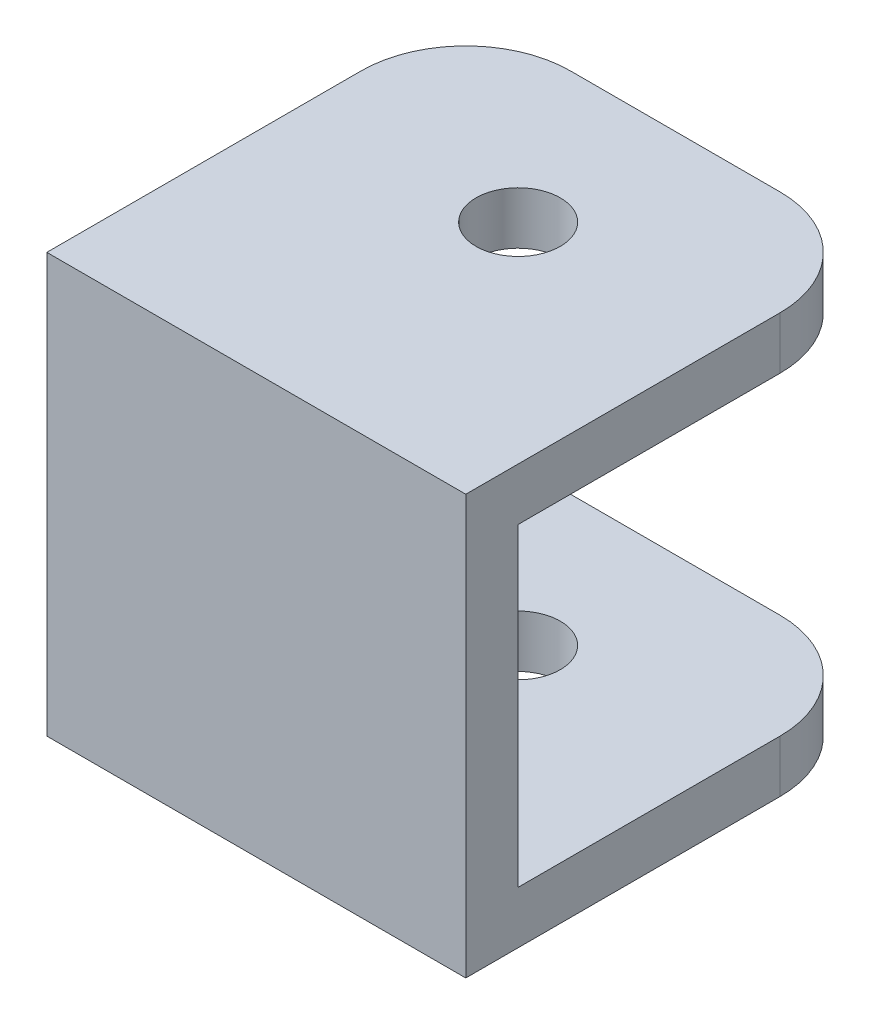
ISO-10303-21;
HEADER;
FILE_DESCRIPTION(('STEP AP214'),'2;1');
FILE_NAME('part.step','',(''),(''),'','','');
FILE_SCHEMA(('AUTOMOTIVE_DESIGN { 1 0 10303 214 1 1 1 1 }'));
ENDSEC;
DATA;
#1=APPLICATION_CONTEXT('core data for automotive mechanical design processes');
#2=APPLICATION_PROTOCOL_DEFINITION('international standard','automotive_design',2000,#1);
#3=PRODUCT_CONTEXT('',#1,'mechanical');
#4=PRODUCT('Part','Part','',(#3));
#5=PRODUCT_RELATED_PRODUCT_CATEGORY('part','',(#4));
#6=PRODUCT_DEFINITION_FORMATION('','',#4);
#7=PRODUCT_DEFINITION_CONTEXT('part definition',#1,'design');
#8=PRODUCT_DEFINITION('design','',#6,#7);
#9=PRODUCT_DEFINITION_SHAPE('','',#8);
#10=(LENGTH_UNIT() NAMED_UNIT(*) SI_UNIT(.MILLI.,.METRE.));
#11=(NAMED_UNIT(*) PLANE_ANGLE_UNIT() SI_UNIT($,.RADIAN.));
#12=(NAMED_UNIT(*) SI_UNIT($,.STERADIAN.) SOLID_ANGLE_UNIT());
#13=UNCERTAINTY_MEASURE_WITH_UNIT(LENGTH_MEASURE(1.E-05),#10,'distance_accuracy_value','');
#14=(GEOMETRIC_REPRESENTATION_CONTEXT(3) GLOBAL_UNCERTAINTY_ASSIGNED_CONTEXT((#13)) GLOBAL_UNIT_ASSIGNED_CONTEXT((#10,
#11,#12)) REPRESENTATION_CONTEXT('',''));
#15=CARTESIAN_POINT('',(0.,0.,0.));
#16=DIRECTION('',(0.,0.,1.));
#17=DIRECTION('',(1.,0.,0.));
#18=AXIS2_PLACEMENT_3D('',#15,#16,#17);
#19=CARTESIAN_POINT('',(-12.7,-12.7,-25.4));
#20=DIRECTION('',(0.,0.,-1.));
#21=DIRECTION('',(-1.,0.,0.));
#22=AXIS2_PLACEMENT_3D('',#19,#20,#21);
#23=PLANE('',#22);
#24=DIRECTION('',(1.,0.,0.));
#25=VECTOR('',#24,1.);
#26=CARTESIAN_POINT('',(-12.7,-12.7,-25.4));
#27=LINE('',#26,#25);
#28=CARTESIAN_POINT('',(-6.35,-12.7,-25.4));
#29=VERTEX_POINT('',#28);
#30=CARTESIAN_POINT('',(6.35,-12.7,-25.4));
#31=VERTEX_POINT('',#30);
#32=EDGE_CURVE('E173',#29,#31,#27,.T.);
#33=ORIENTED_EDGE('',*,*,#32,.F.);
#34=DIRECTION('',(0.,-1.,0.));
#35=VECTOR('',#34,1.);
#36=CARTESIAN_POINT('',(-6.35,45.81144,-25.4));
#37=LINE('',#36,#35);
#38=CARTESIAN_POINT('',(-6.35,-9.525,-25.4));
#39=VERTEX_POINT('',#38);
#40=EDGE_CURVE('E115',#39,#29,#37,.T.);
#41=ORIENTED_EDGE('',*,*,#40,.F.);
#42=DIRECTION('',(1.,0.,0.));
#43=VECTOR('',#42,1.);
#44=CARTESIAN_POINT('',(-12.7,-9.525,-25.4));
#45=LINE('',#44,#43);
#46=CARTESIAN_POINT('',(6.35,-9.525,-25.4));
#47=VERTEX_POINT('',#46);
#48=EDGE_CURVE('E114',#47,#39,#45,.F.);
#49=ORIENTED_EDGE('',*,*,#48,.F.);
#50=DIRECTION('',(0.,1.,0.));
#51=VECTOR('',#50,1.);
#52=CARTESIAN_POINT('',(6.35,-45.81144,-25.4));
#53=LINE('',#52,#51);
#54=EDGE_CURVE('E110',#31,#47,#53,.T.);
#55=ORIENTED_EDGE('',*,*,#54,.F.);
#56=EDGE_LOOP('',(#33,#41,#49,#55));
#57=FACE_BOUND('',#56,.T.);
#58=ADVANCED_FACE('F17',(#57),#23,.T.);
#59=CARTESIAN_POINT('',(0.,-12.7,-15.875));
#60=DIRECTION('',(0.,1.,0.));
#61=DIRECTION('',(0.,0.,1.));
#62=AXIS2_PLACEMENT_3D('',#59,#60,#61);
#63=CYLINDRICAL_SURFACE('',#62,2.5527);
#64=CARTESIAN_POINT('',(0.,-9.525,-15.875));
#65=DIRECTION('',(0.,1.,0.));
#66=DIRECTION('',(0.,0.,1.));
#67=AXIS2_PLACEMENT_3D('',#64,#65,#66);
#68=CIRCLE('',#67,2.5527);
#69=CARTESIAN_POINT('',(0.,-9.525,-13.3223));
#70=VERTEX_POINT('',#69);
#71=EDGE_CURVE('E183',#70,#70,#68,.F.);
#72=ORIENTED_EDGE('',*,*,#71,.F.);
#73=EDGE_LOOP('',(#72));
#74=FACE_BOUND('',#73,.T.);
#75=CARTESIAN_POINT('',(0.,-12.7,-15.875));
#76=DIRECTION('',(0.,1.,0.));
#77=DIRECTION('',(0.,0.,1.));
#78=AXIS2_PLACEMENT_3D('',#75,#76,#77);
#79=CIRCLE('',#78,2.5527);
#80=CARTESIAN_POINT('',(0.,-12.7,-13.3223));
#81=VERTEX_POINT('',#80);
#82=EDGE_CURVE('E125',#81,#81,#79,.T.);
#83=ORIENTED_EDGE('',*,*,#82,.F.);
#84=EDGE_LOOP('',(#83));
#85=FACE_BOUND('',#84,.T.);
#86=ADVANCED_FACE('F313',(#74,#85),#63,.F.);
#87=CARTESIAN_POINT('',(6.35,-45.81144,-19.05));
#88=DIRECTION('',(0.,1.,0.));
#89=DIRECTION('',(0.,0.,1.));
#90=AXIS2_PLACEMENT_3D('',#87,#88,#89);
#91=CYLINDRICAL_SURFACE('',#90,6.35);
#92=ORIENTED_EDGE('',*,*,#54,.T.);
#93=CARTESIAN_POINT('',(6.35,-9.525,-19.05));
#94=DIRECTION('',(0.,1.,0.));
#95=DIRECTION('',(0.,0.,1.));
#96=AXIS2_PLACEMENT_3D('',#93,#94,#95);
#97=CIRCLE('',#96,6.35);
#98=CARTESIAN_POINT('',(12.7,-9.525,-19.05));
#99=VERTEX_POINT('',#98);
#100=EDGE_CURVE('E20',#99,#47,#97,.T.);
#101=ORIENTED_EDGE('',*,*,#100,.F.);
#102=DIRECTION('',(0.,1.,0.));
#103=VECTOR('',#102,1.);
#104=CARTESIAN_POINT('',(12.7,0.,-19.05));
#105=LINE('',#104,#103);
#106=CARTESIAN_POINT('',(12.7,-12.7,-19.05));
#107=VERTEX_POINT('',#106);
#108=EDGE_CURVE('E108',#107,#99,#105,.T.);
#109=ORIENTED_EDGE('',*,*,#108,.F.);
#110=CARTESIAN_POINT('',(6.35,-12.7,-19.05));
#111=DIRECTION('',(0.,1.,0.));
#112=DIRECTION('',(0.,0.,1.));
#113=AXIS2_PLACEMENT_3D('',#110,#111,#112);
#114=CIRCLE('',#113,6.35);
#115=EDGE_CURVE('E171',#31,#107,#114,.F.);
#116=ORIENTED_EDGE('',*,*,#115,.F.);
#117=EDGE_LOOP('',(#92,#101,#109,#116));
#118=FACE_BOUND('',#117,.T.);
#119=ADVANCED_FACE('F105',(#118),#91,.T.);
#120=CARTESIAN_POINT('',(-12.7,9.525,-25.4));
#121=DIRECTION('',(0.,0.,-1.));
#122=DIRECTION('',(-1.,0.,0.));
#123=AXIS2_PLACEMENT_3D('',#120,#121,#122);
#124=PLANE('',#123);
#125=DIRECTION('',(1.,0.,0.));
#126=VECTOR('',#125,1.);
#127=CARTESIAN_POINT('',(-12.7,12.7,-25.4));
#128=LINE('',#127,#126);
#129=CARTESIAN_POINT('',(6.35,12.7,-25.4));
#130=VERTEX_POINT('',#129);
#131=CARTESIAN_POINT('',(-6.35,12.7,-25.4));
#132=VERTEX_POINT('',#131);
#133=EDGE_CURVE('E130',#130,#132,#128,.F.);
#134=ORIENTED_EDGE('',*,*,#133,.F.);
#135=DIRECTION('',(0.,1.,0.));
#136=VECTOR('',#135,1.);
#137=CARTESIAN_POINT('',(6.35,-45.81144,-25.4));
#138=LINE('',#137,#136);
#139=CARTESIAN_POINT('',(6.35,9.525,-25.4));
#140=VERTEX_POINT('',#139);
#141=EDGE_CURVE('E155',#140,#130,#138,.T.);
#142=ORIENTED_EDGE('',*,*,#141,.F.);
#143=DIRECTION('',(1.,0.,0.));
#144=VECTOR('',#143,1.);
#145=CARTESIAN_POINT('',(-12.7,9.525,-25.4));
#146=LINE('',#145,#144);
#147=CARTESIAN_POINT('',(-6.35,9.525,-25.4));
#148=VERTEX_POINT('',#147);
#149=EDGE_CURVE('E182',#148,#140,#146,.T.);
#150=ORIENTED_EDGE('',*,*,#149,.F.);
#151=DIRECTION('',(0.,-1.,0.));
#152=VECTOR('',#151,1.);
#153=CARTESIAN_POINT('',(-6.35,45.81144,-25.4));
#154=LINE('',#153,#152);
#155=EDGE_CURVE('E138',#132,#148,#154,.T.);
#156=ORIENTED_EDGE('',*,*,#155,.F.);
#157=EDGE_LOOP('',(#134,#142,#150,#156));
#158=FACE_BOUND('',#157,.T.);
#159=ADVANCED_FACE('F259',(#158),#124,.T.);
#160=CARTESIAN_POINT('',(6.35,-45.81144,-19.05));
#161=DIRECTION('',(0.,1.,0.));
#162=DIRECTION('',(0.,0.,1.));
#163=AXIS2_PLACEMENT_3D('',#160,#161,#162);
#164=CYLINDRICAL_SURFACE('',#163,6.35);
#165=ORIENTED_EDGE('',*,*,#141,.T.);
#166=CARTESIAN_POINT('',(6.35,12.7,-19.05));
#167=DIRECTION('',(0.,1.,0.));
#168=DIRECTION('',(0.,0.,1.));
#169=AXIS2_PLACEMENT_3D('',#166,#167,#168);
#170=CIRCLE('',#169,6.35);
#171=CARTESIAN_POINT('',(12.7,12.7,-19.05));
#172=VERTEX_POINT('',#171);
#173=EDGE_CURVE('E161',#172,#130,#170,.T.);
#174=ORIENTED_EDGE('',*,*,#173,.F.);
#175=DIRECTION('',(0.,1.,0.));
#176=VECTOR('',#175,1.);
#177=CARTESIAN_POINT('',(12.7,0.,-19.05));
#178=LINE('',#177,#176);
#179=CARTESIAN_POINT('',(12.7,9.525,-19.05));
#180=VERTEX_POINT('',#179);
#181=EDGE_CURVE('E135',#180,#172,#178,.T.);
#182=ORIENTED_EDGE('',*,*,#181,.F.);
#183=CARTESIAN_POINT('',(6.35,9.525,-19.05));
#184=DIRECTION('',(0.,1.,0.));
#185=DIRECTION('',(0.,0.,1.));
#186=AXIS2_PLACEMENT_3D('',#183,#184,#185);
#187=CIRCLE('',#186,6.35);
#188=EDGE_CURVE('E180',#140,#180,#187,.F.);
#189=ORIENTED_EDGE('',*,*,#188,.F.);
#190=EDGE_LOOP('',(#165,#174,#182,#189));
#191=FACE_BOUND('',#190,.T.);
#192=ADVANCED_FACE('F257',(#191),#164,.T.);
#193=CARTESIAN_POINT('',(0.,-12.7,-15.875));
#194=DIRECTION('',(0.,1.,0.));
#195=DIRECTION('',(0.,0.,1.));
#196=AXIS2_PLACEMENT_3D('',#193,#194,#195);
#197=CYLINDRICAL_SURFACE('',#196,2.5527);
#198=CARTESIAN_POINT('',(0.,9.525,-15.875));
#199=DIRECTION('',(0.,1.,0.));
#200=DIRECTION('',(0.,0.,1.));
#201=AXIS2_PLACEMENT_3D('',#198,#199,#200);
#202=CIRCLE('',#201,2.5527);
#203=CARTESIAN_POINT('',(0.,9.525,-13.3223));
#204=VERTEX_POINT('',#203);
#205=EDGE_CURVE('E177',#204,#204,#202,.T.);
#206=ORIENTED_EDGE('',*,*,#205,.F.);
#207=EDGE_LOOP('',(#206));
#208=FACE_BOUND('',#207,.T.);
#209=CARTESIAN_POINT('',(0.,12.7,-15.875));
#210=DIRECTION('',(0.,1.,0.));
#211=DIRECTION('',(0.,0.,1.));
#212=AXIS2_PLACEMENT_3D('',#209,#210,#211);
#213=CIRCLE('',#212,2.5527);
#214=CARTESIAN_POINT('',(0.,12.7,-13.3223));
#215=VERTEX_POINT('',#214);
#216=EDGE_CURVE('E157',#215,#215,#213,.F.);
#217=ORIENTED_EDGE('',*,*,#216,.F.);
#218=EDGE_LOOP('',(#217));
#219=FACE_BOUND('',#218,.T.);
#220=ADVANCED_FACE('F304',(#208,#219),#197,.F.);
#221=CARTESIAN_POINT('',(-6.35,45.81144,-19.05));
#222=DIRECTION('',(0.,-1.,0.));
#223=DIRECTION('',(0.,0.,-1.));
#224=AXIS2_PLACEMENT_3D('',#221,#222,#223);
#225=CYLINDRICAL_SURFACE('',#224,6.35);
#226=ORIENTED_EDGE('',*,*,#40,.T.);
#227=CARTESIAN_POINT('',(-6.35,-12.7,-19.05));
#228=DIRECTION('',(0.,-1.,0.));
#229=DIRECTION('',(0.,0.,-1.));
#230=AXIS2_PLACEMENT_3D('',#227,#228,#229);
#231=CIRCLE('',#230,6.35);
#232=CARTESIAN_POINT('',(-12.7,-12.7,-19.05));
#233=VERTEX_POINT('',#232);
#234=EDGE_CURVE('E168',#233,#29,#231,.T.);
#235=ORIENTED_EDGE('',*,*,#234,.F.);
#236=DIRECTION('',(0.,1.,0.));
#237=VECTOR('',#236,1.);
#238=CARTESIAN_POINT('',(-12.7,0.,-19.05));
#239=LINE('',#238,#237);
#240=CARTESIAN_POINT('',(-12.7,-9.525,-19.05));
#241=VERTEX_POINT('',#240);
#242=EDGE_CURVE('E160',#233,#241,#239,.T.);
#243=ORIENTED_EDGE('',*,*,#242,.T.);
#244=CARTESIAN_POINT('',(-6.35,-9.525,-19.05));
#245=DIRECTION('',(0.,-1.,0.));
#246=DIRECTION('',(0.,0.,-1.));
#247=AXIS2_PLACEMENT_3D('',#244,#245,#246);
#248=CIRCLE('',#247,6.35);
#249=EDGE_CURVE('E185',#39,#241,#248,.F.);
#250=ORIENTED_EDGE('',*,*,#249,.F.);
#251=EDGE_LOOP('',(#226,#235,#243,#250));
#252=FACE_BOUND('',#251,.T.);
#253=ADVANCED_FACE('F300',(#252),#225,.T.);
#254=CARTESIAN_POINT('',(-12.7,-9.525,-25.4));
#255=DIRECTION('',(0.,1.,0.));
#256=DIRECTION('',(0.,0.,1.));
#257=AXIS2_PLACEMENT_3D('',#254,#255,#256);
#258=PLANE('',#257);
#259=ORIENTED_EDGE('',*,*,#71,.T.);
#260=EDGE_LOOP('',(#259));
#261=FACE_BOUND('',#260,.T.);
#262=ORIENTED_EDGE('',*,*,#48,.T.);
#263=ORIENTED_EDGE('',*,*,#249,.T.);
#264=DIRECTION('',(0.,0.,-1.));
#265=VECTOR('',#264,1.);
#266=CARTESIAN_POINT('',(-12.7,-9.525,0.));
#267=LINE('',#266,#265);
#268=CARTESIAN_POINT('',(-12.7,-9.525,-3.175));
#269=VERTEX_POINT('',#268);
#270=EDGE_CURVE('E237',#241,#269,#267,.F.);
#271=ORIENTED_EDGE('',*,*,#270,.T.);
#272=DIRECTION('',(-1.,0.,0.));
#273=VECTOR('',#272,1.);
#274=CARTESIAN_POINT('',(-12.7,-9.525,-3.175));
#275=LINE('',#274,#273);
#276=CARTESIAN_POINT('',(12.7,-9.525,-3.175));
#277=VERTEX_POINT('',#276);
#278=EDGE_CURVE('E120',#277,#269,#275,.T.);
#279=ORIENTED_EDGE('',*,*,#278,.F.);
#280=DIRECTION('',(0.,0.,-1.));
#281=VECTOR('',#280,1.);
#282=CARTESIAN_POINT('',(12.7,-9.525,0.));
#283=LINE('',#282,#281);
#284=EDGE_CURVE('E117',#99,#277,#283,.F.);
#285=ORIENTED_EDGE('',*,*,#284,.F.);
#286=ORIENTED_EDGE('',*,*,#100,.T.);
#287=EDGE_LOOP('',(#262,#263,#271,#279,#285,#286));
#288=FACE_BOUND('',#287,.T.);
#289=ADVANCED_FACE('F118',(#261,#288),#258,.T.);
#290=CARTESIAN_POINT('',(-12.7,-9.525,-3.175));
#291=DIRECTION('',(0.,0.,-1.));
#292=DIRECTION('',(-1.,0.,0.));
#293=AXIS2_PLACEMENT_3D('',#290,#291,#292);
#294=PLANE('',#293);
#295=ORIENTED_EDGE('',*,*,#278,.T.);
#296=DIRECTION('',(0.,1.,0.));
#297=VECTOR('',#296,1.);
#298=CARTESIAN_POINT('',(-12.7,0.,-3.175));
#299=LINE('',#298,#297);
#300=CARTESIAN_POINT('',(-12.7,9.525,-3.175));
#301=VERTEX_POINT('',#300);
#302=EDGE_CURVE('E226',#269,#301,#299,.T.);
#303=ORIENTED_EDGE('',*,*,#302,.T.);
#304=DIRECTION('',(1.,0.,0.));
#305=VECTOR('',#304,1.);
#306=CARTESIAN_POINT('',(-12.7,9.525,-3.175));
#307=LINE('',#306,#305);
#308=CARTESIAN_POINT('',(12.7,9.525,-3.175));
#309=VERTEX_POINT('',#308);
#310=EDGE_CURVE('E231',#309,#301,#307,.F.);
#311=ORIENTED_EDGE('',*,*,#310,.F.);
#312=DIRECTION('',(0.,1.,0.));
#313=VECTOR('',#312,1.);
#314=CARTESIAN_POINT('',(12.7,0.,-3.175));
#315=LINE('',#314,#313);
#316=EDGE_CURVE('E124',#277,#309,#315,.T.);
#317=ORIENTED_EDGE('',*,*,#316,.F.);
#318=EDGE_LOOP('',(#295,#303,#311,#317));
#319=FACE_BOUND('',#318,.T.);
#320=ADVANCED_FACE('F293',(#319),#294,.T.);
#321=CARTESIAN_POINT('',(-12.7,9.525,-3.175));
#322=DIRECTION('',(0.,-1.,0.));
#323=DIRECTION('',(0.,0.,-1.));
#324=AXIS2_PLACEMENT_3D('',#321,#322,#323);
#325=PLANE('',#324);
#326=ORIENTED_EDGE('',*,*,#205,.T.);
#327=EDGE_LOOP('',(#326));
#328=FACE_BOUND('',#327,.T.);
#329=ORIENTED_EDGE('',*,*,#149,.T.);
#330=ORIENTED_EDGE('',*,*,#188,.T.);
#331=DIRECTION('',(0.,0.,-1.));
#332=VECTOR('',#331,1.);
#333=CARTESIAN_POINT('',(12.7,9.525,0.));
#334=LINE('',#333,#332);
#335=EDGE_CURVE('E143',#309,#180,#334,.T.);
#336=ORIENTED_EDGE('',*,*,#335,.F.);
#337=ORIENTED_EDGE('',*,*,#310,.T.);
#338=DIRECTION('',(0.,0.,-1.));
#339=VECTOR('',#338,1.);
#340=CARTESIAN_POINT('',(-12.7,9.525,0.));
#341=LINE('',#340,#339);
#342=CARTESIAN_POINT('',(-12.7,9.525,-19.05));
#343=VERTEX_POINT('',#342);
#344=EDGE_CURVE('E219',#301,#343,#341,.T.);
#345=ORIENTED_EDGE('',*,*,#344,.T.);
#346=CARTESIAN_POINT('',(-6.35,9.525,-19.05));
#347=DIRECTION('',(0.,-1.,0.));
#348=DIRECTION('',(0.,0.,-1.));
#349=AXIS2_PLACEMENT_3D('',#346,#347,#348);
#350=CIRCLE('',#349,6.35);
#351=EDGE_CURVE('E174',#148,#343,#350,.F.);
#352=ORIENTED_EDGE('',*,*,#351,.F.);
#353=EDGE_LOOP('',(#329,#330,#336,#337,#345,#352));
#354=FACE_BOUND('',#353,.T.);
#355=ADVANCED_FACE('F290',(#328,#354),#325,.T.);
#356=CARTESIAN_POINT('',(-6.35,45.81144,-19.05));
#357=DIRECTION('',(0.,-1.,0.));
#358=DIRECTION('',(0.,0.,-1.));
#359=AXIS2_PLACEMENT_3D('',#356,#357,#358);
#360=CYLINDRICAL_SURFACE('',#359,6.35);
#361=ORIENTED_EDGE('',*,*,#155,.T.);
#362=ORIENTED_EDGE('',*,*,#351,.T.);
#363=DIRECTION('',(0.,1.,0.));
#364=VECTOR('',#363,1.);
#365=CARTESIAN_POINT('',(-12.7,0.,-19.05));
#366=LINE('',#365,#364);
#367=CARTESIAN_POINT('',(-12.7,12.7,-19.05));
#368=VERTEX_POINT('',#367);
#369=EDGE_CURVE('E217',#343,#368,#366,.T.);
#370=ORIENTED_EDGE('',*,*,#369,.T.);
#371=CARTESIAN_POINT('',(-6.35,12.7,-19.05));
#372=DIRECTION('',(0.,-1.,0.));
#373=DIRECTION('',(0.,0.,-1.));
#374=AXIS2_PLACEMENT_3D('',#371,#372,#373);
#375=CIRCLE('',#374,6.35);
#376=EDGE_CURVE('E133',#132,#368,#375,.F.);
#377=ORIENTED_EDGE('',*,*,#376,.F.);
#378=EDGE_LOOP('',(#361,#362,#370,#377));
#379=FACE_BOUND('',#378,.T.);
#380=ADVANCED_FACE('F286',(#379),#360,.T.);
#381=CARTESIAN_POINT('',(-12.7,-12.7,0.));
#382=DIRECTION('',(0.,-1.,0.));
#383=DIRECTION('',(0.,0.,-1.));
#384=AXIS2_PLACEMENT_3D('',#381,#382,#383);
#385=PLANE('',#384);
#386=ORIENTED_EDGE('',*,*,#82,.T.);
#387=EDGE_LOOP('',(#386));
#388=FACE_BOUND('',#387,.T.);
#389=DIRECTION('',(0.,0.,-1.));
#390=VECTOR('',#389,1.);
#391=CARTESIAN_POINT('',(-12.7,-12.7,0.));
#392=LINE('',#391,#390);
#393=CARTESIAN_POINT('',(-12.7,-12.7,0.));
#394=VERTEX_POINT('',#393);
#395=EDGE_CURVE('E205',#394,#233,#392,.T.);
#396=ORIENTED_EDGE('',*,*,#395,.T.);
#397=ORIENTED_EDGE('',*,*,#234,.T.);
#398=ORIENTED_EDGE('',*,*,#32,.T.);
#399=ORIENTED_EDGE('',*,*,#115,.T.);
#400=DIRECTION('',(0.,0.,-1.));
#401=VECTOR('',#400,1.);
#402=CARTESIAN_POINT('',(12.7,-12.7,0.));
#403=LINE('',#402,#401);
#404=CARTESIAN_POINT('',(12.7,-12.7,0.));
#405=VERTEX_POINT('',#404);
#406=EDGE_CURVE('E129',#405,#107,#403,.T.);
#407=ORIENTED_EDGE('',*,*,#406,.F.);
#408=DIRECTION('',(1.,0.,0.));
#409=VECTOR('',#408,1.);
#410=CARTESIAN_POINT('',(-12.7,-12.7,0.));
#411=LINE('',#410,#409);
#412=EDGE_CURVE('E199',#394,#405,#411,.T.);
#413=ORIENTED_EDGE('',*,*,#412,.F.);
#414=EDGE_LOOP('',(#396,#397,#398,#399,#407,#413));
#415=FACE_BOUND('',#414,.T.);
#416=ADVANCED_FACE('F283',(#388,#415),#385,.T.);
#417=CARTESIAN_POINT('',(12.7,0.,0.));
#418=DIRECTION('',(1.,0.,0.));
#419=DIRECTION('',(0.,0.,-1.));
#420=AXIS2_PLACEMENT_3D('',#417,#418,#419);
#421=PLANE('',#420);
#422=ORIENTED_EDGE('',*,*,#406,.T.);
#423=ORIENTED_EDGE('',*,*,#108,.T.);
#424=ORIENTED_EDGE('',*,*,#284,.T.);
#425=ORIENTED_EDGE('',*,*,#316,.T.);
#426=ORIENTED_EDGE('',*,*,#335,.T.);
#427=ORIENTED_EDGE('',*,*,#181,.T.);
#428=DIRECTION('',(0.,0.,1.));
#429=VECTOR('',#428,1.);
#430=CARTESIAN_POINT('',(12.7,12.7,-25.4));
#431=LINE('',#430,#429);
#432=CARTESIAN_POINT('',(12.7,12.7,0.));
#433=VERTEX_POINT('',#432);
#434=EDGE_CURVE('E164',#433,#172,#431,.F.);
#435=ORIENTED_EDGE('',*,*,#434,.F.);
#436=DIRECTION('',(0.,1.,0.));
#437=VECTOR('',#436,1.);
#438=CARTESIAN_POINT('',(12.7,12.7,0.));
#439=LINE('',#438,#437);
#440=EDGE_CURVE('E197',#405,#433,#439,.T.);
#441=ORIENTED_EDGE('',*,*,#440,.F.);
#442=EDGE_LOOP('',(#422,#423,#424,#425,#426,#427,#435,#441));
#443=FACE_BOUND('',#442,.T.);
#444=ADVANCED_FACE('F127',(#443),#421,.T.);
#445=CARTESIAN_POINT('',(-12.7,12.7,-25.4));
#446=DIRECTION('',(0.,1.,0.));
#447=DIRECTION('',(0.,0.,1.));
#448=AXIS2_PLACEMENT_3D('',#445,#446,#447);
#449=PLANE('',#448);
#450=ORIENTED_EDGE('',*,*,#216,.T.);
#451=EDGE_LOOP('',(#450));
#452=FACE_BOUND('',#451,.T.);
#453=ORIENTED_EDGE('',*,*,#434,.T.);
#454=ORIENTED_EDGE('',*,*,#173,.T.);
#455=ORIENTED_EDGE('',*,*,#133,.T.);
#456=ORIENTED_EDGE('',*,*,#376,.T.);
#457=DIRECTION('',(0.,0.,-1.));
#458=VECTOR('',#457,1.);
#459=CARTESIAN_POINT('',(-12.7,12.7,0.));
#460=LINE('',#459,#458);
#461=CARTESIAN_POINT('',(-12.7,12.7,0.));
#462=VERTEX_POINT('',#461);
#463=EDGE_CURVE('E35',#368,#462,#460,.F.);
#464=ORIENTED_EDGE('',*,*,#463,.T.);
#465=DIRECTION('',(1.,0.,0.));
#466=VECTOR('',#465,1.);
#467=CARTESIAN_POINT('',(-12.7,12.7,0.));
#468=LINE('',#467,#466);
#469=EDGE_CURVE('E26',#433,#462,#468,.F.);
#470=ORIENTED_EDGE('',*,*,#469,.F.);
#471=EDGE_LOOP('',(#453,#454,#455,#456,#464,#470));
#472=FACE_BOUND('',#471,.T.);
#473=ADVANCED_FACE('F251',(#452,#472),#449,.T.);
#474=CARTESIAN_POINT('',(-12.7,0.,0.));
#475=DIRECTION('',(1.,0.,0.));
#476=DIRECTION('',(0.,0.,-1.));
#477=AXIS2_PLACEMENT_3D('',#474,#475,#476);
#478=PLANE('',#477);
#479=DIRECTION('',(0.,1.,0.));
#480=VECTOR('',#479,1.);
#481=CARTESIAN_POINT('',(-12.7,12.7,0.));
#482=LINE('',#481,#480);
#483=EDGE_CURVE('E11',#462,#394,#482,.F.);
#484=ORIENTED_EDGE('',*,*,#483,.F.);
#485=ORIENTED_EDGE('',*,*,#463,.F.);
#486=ORIENTED_EDGE('',*,*,#369,.F.);
#487=ORIENTED_EDGE('',*,*,#344,.F.);
#488=ORIENTED_EDGE('',*,*,#302,.F.);
#489=ORIENTED_EDGE('',*,*,#270,.F.);
#490=ORIENTED_EDGE('',*,*,#242,.F.);
#491=ORIENTED_EDGE('',*,*,#395,.F.);
#492=EDGE_LOOP('',(#484,#485,#486,#487,#488,#489,#490,#491));
#493=FACE_BOUND('',#492,.T.);
#494=ADVANCED_FACE('F266',(#493),#478,.F.);
#495=CARTESIAN_POINT('',(-12.7,12.7,0.));
#496=DIRECTION('',(0.,0.,1.));
#497=DIRECTION('',(1.,0.,0.));
#498=AXIS2_PLACEMENT_3D('',#495,#496,#497);
#499=PLANE('',#498);
#500=ORIENTED_EDGE('',*,*,#469,.T.);
#501=ORIENTED_EDGE('',*,*,#483,.T.);
#502=ORIENTED_EDGE('',*,*,#412,.T.);
#503=ORIENTED_EDGE('',*,*,#440,.T.);
#504=EDGE_LOOP('',(#500,#501,#502,#503));
#505=FACE_BOUND('',#504,.T.);
#506=ADVANCED_FACE('F269',(#505),#499,.T.);
#507=CLOSED_SHELL('',(#58,#86,#119,#159,#192,#220,#253,#289,#320,#355,#380,#416,#444,#473,#494,#506));
#508=MANIFOLD_SOLID_BREP('B1',#507);
#509=ADVANCED_BREP_SHAPE_REPRESENTATION('',(#18,#508),#14);
#510=SHAPE_DEFINITION_REPRESENTATION(#9,#509);
ENDSEC;
END-ISO-10303-21;
